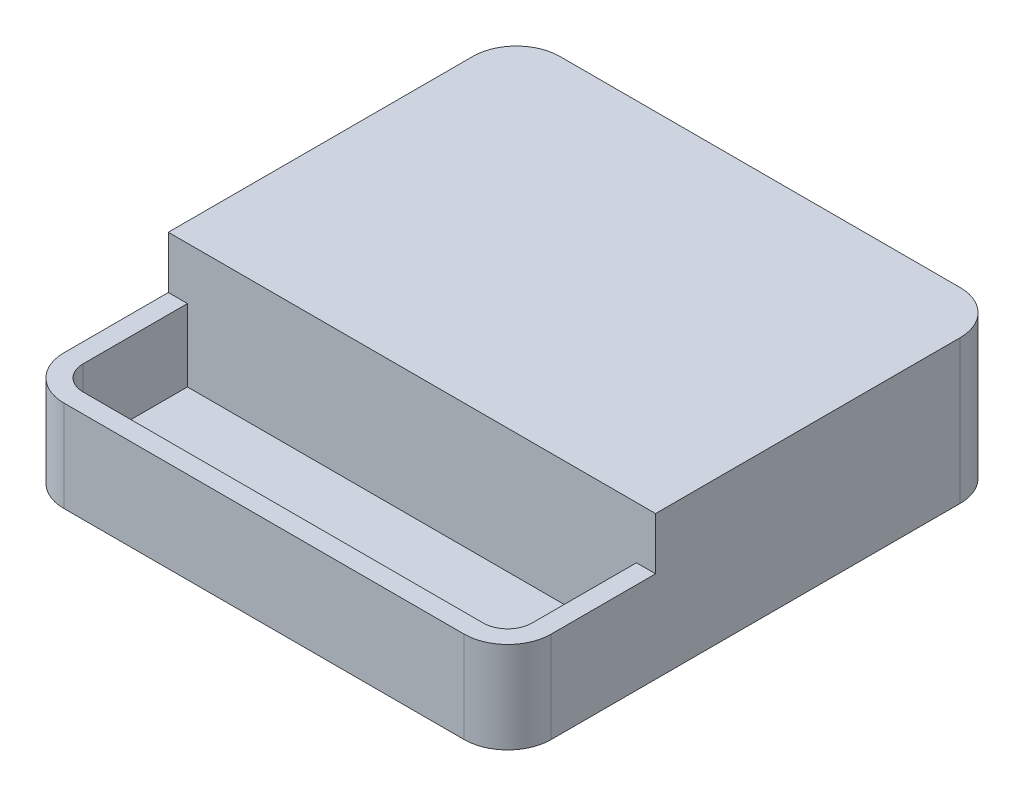
ISO-10303-21;
HEADER;
FILE_DESCRIPTION(('STEP AP214'),'2;1');
FILE_NAME('part.step','',(''),(''),'','','');
FILE_SCHEMA(('AUTOMOTIVE_DESIGN { 1 0 10303 214 1 1 1 1 }'));
ENDSEC;
DATA;
#1=APPLICATION_CONTEXT('core data for automotive mechanical design processes');
#2=APPLICATION_PROTOCOL_DEFINITION('international standard','automotive_design',2000,#1);
#3=PRODUCT_CONTEXT('',#1,'mechanical');
#4=PRODUCT('Part','Part','',(#3));
#5=PRODUCT_RELATED_PRODUCT_CATEGORY('part','',(#4));
#6=PRODUCT_DEFINITION_FORMATION('','',#4);
#7=PRODUCT_DEFINITION_CONTEXT('part definition',#1,'design');
#8=PRODUCT_DEFINITION('design','',#6,#7);
#9=PRODUCT_DEFINITION_SHAPE('','',#8);
#10=(LENGTH_UNIT() NAMED_UNIT(*) SI_UNIT(.MILLI.,.METRE.));
#11=(NAMED_UNIT(*) PLANE_ANGLE_UNIT() SI_UNIT($,.RADIAN.));
#12=(NAMED_UNIT(*) SI_UNIT($,.STERADIAN.) SOLID_ANGLE_UNIT());
#13=UNCERTAINTY_MEASURE_WITH_UNIT(LENGTH_MEASURE(1.E-05),#10,'distance_accuracy_value','');
#14=(GEOMETRIC_REPRESENTATION_CONTEXT(3) GLOBAL_UNCERTAINTY_ASSIGNED_CONTEXT((#13)) GLOBAL_UNIT_ASSIGNED_CONTEXT((#10,
#11,#12)) REPRESENTATION_CONTEXT('',''));
#15=CARTESIAN_POINT('',(0.,0.,0.));
#16=DIRECTION('',(0.,0.,1.));
#17=DIRECTION('',(1.,0.,0.));
#18=AXIS2_PLACEMENT_3D('',#15,#16,#17);
#19=CARTESIAN_POINT('',(-23.,16.5,23.5));
#20=DIRECTION('',(0.,-1.,0.));
#21=DIRECTION('',(0.,0.,-1.));
#22=AXIS2_PLACEMENT_3D('',#19,#20,#21);
#23=CYLINDRICAL_SURFACE('',#22,5.00000000000001);
#24=CARTESIAN_POINT('',(-23.,10.5,23.5));
#25=DIRECTION('',(0.,1.,0.));
#26=DIRECTION('',(0.,0.,1.));
#27=AXIS2_PLACEMENT_3D('',#24,#25,#26);
#28=CIRCLE('',#27,5.00000000000001);
#29=CARTESIAN_POINT('',(-28.,10.5,23.5));
#30=VERTEX_POINT('',#29);
#31=CARTESIAN_POINT('',(-23.,10.5,28.5));
#32=VERTEX_POINT('',#31);
#33=EDGE_CURVE('E221',#30,#32,#28,.T.);
#34=ORIENTED_EDGE('',*,*,#33,.F.);
#35=DIRECTION('',(0.,-1.,0.));
#36=VECTOR('',#35,1.);
#37=CARTESIAN_POINT('',(-28.,16.5,23.5));
#38=LINE('',#37,#36);
#39=CARTESIAN_POINT('',(-28.,0.,23.5));
#40=VERTEX_POINT('',#39);
#41=EDGE_CURVE('E271',#30,#40,#38,.T.);
#42=ORIENTED_EDGE('',*,*,#41,.T.);
#43=CARTESIAN_POINT('',(-23.,0.,23.5));
#44=DIRECTION('',(0.,1.,0.));
#45=DIRECTION('',(0.,0.,1.));
#46=AXIS2_PLACEMENT_3D('',#43,#44,#45);
#47=CIRCLE('',#46,5.00000000000001);
#48=CARTESIAN_POINT('',(-23.,0.,28.5));
#49=VERTEX_POINT('',#48);
#50=EDGE_CURVE('E243',#40,#49,#47,.T.);
#51=ORIENTED_EDGE('',*,*,#50,.T.);
#52=DIRECTION('',(0.,-1.,0.));
#53=VECTOR('',#52,1.);
#54=CARTESIAN_POINT('',(-23.,16.5,28.5));
#55=LINE('',#54,#53);
#56=EDGE_CURVE('E269',#32,#49,#55,.T.);
#57=ORIENTED_EDGE('',*,*,#56,.F.);
#58=EDGE_LOOP('',(#34,#42,#51,#57));
#59=FACE_BOUND('',#58,.T.);
#60=ADVANCED_FACE('F41',(#59),#23,.T.);
#61=CARTESIAN_POINT('',(-23.,16.5,28.5));
#62=DIRECTION('',(0.,0.,-1.));
#63=DIRECTION('',(-1.,0.,0.));
#64=AXIS2_PLACEMENT_3D('',#61,#62,#63);
#65=PLANE('',#64);
#66=DIRECTION('',(1.,0.,0.));
#67=VECTOR('',#66,1.);
#68=CARTESIAN_POINT('',(-28.,10.5,28.5));
#69=LINE('',#68,#67);
#70=CARTESIAN_POINT('',(23.,10.5,28.5));
#71=VERTEX_POINT('',#70);
#72=EDGE_CURVE('E206',#32,#71,#69,.T.);
#73=ORIENTED_EDGE('',*,*,#72,.F.);
#74=ORIENTED_EDGE('',*,*,#56,.T.);
#75=DIRECTION('',(1.,0.,0.));
#76=VECTOR('',#75,1.);
#77=CARTESIAN_POINT('',(-23.,0.,28.5));
#78=LINE('',#77,#76);
#79=CARTESIAN_POINT('',(23.,0.,28.5));
#80=VERTEX_POINT('',#79);
#81=EDGE_CURVE('E246',#49,#80,#78,.T.);
#82=ORIENTED_EDGE('',*,*,#81,.T.);
#83=DIRECTION('',(0.,-1.,0.));
#84=VECTOR('',#83,1.);
#85=CARTESIAN_POINT('',(23.,16.5,28.5));
#86=LINE('',#85,#84);
#87=EDGE_CURVE('E267',#71,#80,#86,.T.);
#88=ORIENTED_EDGE('',*,*,#87,.F.);
#89=EDGE_LOOP('',(#73,#74,#82,#88));
#90=FACE_BOUND('',#89,.T.);
#91=ADVANCED_FACE('F346',(#90),#65,.F.);
#92=CARTESIAN_POINT('',(23.,16.5,23.5));
#93=DIRECTION('',(0.,-1.,0.));
#94=DIRECTION('',(0.,0.,-1.));
#95=AXIS2_PLACEMENT_3D('',#92,#93,#94);
#96=CYLINDRICAL_SURFACE('',#95,5.);
#97=CARTESIAN_POINT('',(23.,10.5,23.5));
#98=DIRECTION('',(0.,1.,0.));
#99=DIRECTION('',(0.,0.,1.));
#100=AXIS2_PLACEMENT_3D('',#97,#98,#99);
#101=CIRCLE('',#100,5.);
#102=CARTESIAN_POINT('',(28.,10.5,23.5));
#103=VERTEX_POINT('',#102);
#104=EDGE_CURVE('E218',#71,#103,#101,.T.);
#105=ORIENTED_EDGE('',*,*,#104,.F.);
#106=ORIENTED_EDGE('',*,*,#87,.T.);
#107=CARTESIAN_POINT('',(23.,0.,23.5));
#108=DIRECTION('',(0.,1.,0.));
#109=DIRECTION('',(0.,0.,-1.));
#110=AXIS2_PLACEMENT_3D('',#107,#108,#109);
#111=CIRCLE('',#110,5.);
#112=CARTESIAN_POINT('',(28.,0.,23.5));
#113=VERTEX_POINT('',#112);
#114=EDGE_CURVE('E249',#80,#113,#111,.T.);
#115=ORIENTED_EDGE('',*,*,#114,.T.);
#116=DIRECTION('',(0.,-1.,0.));
#117=VECTOR('',#116,1.);
#118=CARTESIAN_POINT('',(28.,16.5,23.5));
#119=LINE('',#118,#117);
#120=EDGE_CURVE('E265',#103,#113,#119,.T.);
#121=ORIENTED_EDGE('',*,*,#120,.F.);
#122=EDGE_LOOP('',(#105,#106,#115,#121));
#123=FACE_BOUND('',#122,.T.);
#124=ADVANCED_FACE('F351',(#123),#96,.T.);
#125=CARTESIAN_POINT('',(-23.,16.5,-23.5));
#126=DIRECTION('',(0.,-1.,0.));
#127=DIRECTION('',(0.,0.,-1.));
#128=AXIS2_PLACEMENT_3D('',#125,#126,#127);
#129=CYLINDRICAL_SURFACE('',#128,5.);
#130=CARTESIAN_POINT('',(-23.,0.,-23.5));
#131=DIRECTION('',(0.,1.,0.));
#132=DIRECTION('',(0.,0.,1.));
#133=AXIS2_PLACEMENT_3D('',#130,#131,#132);
#134=CIRCLE('',#133,5.);
#135=CARTESIAN_POINT('',(-23.,0.,-28.5));
#136=VERTEX_POINT('',#135);
#137=CARTESIAN_POINT('',(-28.,0.,-23.5));
#138=VERTEX_POINT('',#137);
#139=EDGE_CURVE('E223',#136,#138,#134,.T.);
#140=ORIENTED_EDGE('',*,*,#139,.T.);
#141=DIRECTION('',(0.,-1.,0.));
#142=VECTOR('',#141,1.);
#143=CARTESIAN_POINT('',(-28.,16.5,-23.5));
#144=LINE('',#143,#142);
#145=CARTESIAN_POINT('',(-28.,16.5,-23.5));
#146=VERTEX_POINT('',#145);
#147=EDGE_CURVE('E273',#146,#138,#144,.T.);
#148=ORIENTED_EDGE('',*,*,#147,.F.);
#149=CARTESIAN_POINT('',(-23.,16.5,-23.5));
#150=DIRECTION('',(0.,1.,0.));
#151=DIRECTION('',(0.,0.,1.));
#152=AXIS2_PLACEMENT_3D('',#149,#150,#151);
#153=CIRCLE('',#152,5.);
#154=CARTESIAN_POINT('',(-23.,16.5,-28.5));
#155=VERTEX_POINT('',#154);
#156=EDGE_CURVE('E224',#155,#146,#153,.T.);
#157=ORIENTED_EDGE('',*,*,#156,.F.);
#158=DIRECTION('',(0.,-1.,0.));
#159=VECTOR('',#158,1.);
#160=CARTESIAN_POINT('',(-23.,16.5,-28.5));
#161=LINE('',#160,#159);
#162=EDGE_CURVE('E237',#155,#136,#161,.T.);
#163=ORIENTED_EDGE('',*,*,#162,.T.);
#164=EDGE_LOOP('',(#140,#148,#157,#163));
#165=FACE_BOUND('',#164,.T.);
#166=ADVANCED_FACE('F43',(#165),#129,.T.);
#167=CARTESIAN_POINT('',(-28.,16.5,-23.5));
#168=DIRECTION('',(1.,0.,0.));
#169=DIRECTION('',(0.,0.,-1.));
#170=AXIS2_PLACEMENT_3D('',#167,#168,#169);
#171=PLANE('',#170);
#172=DIRECTION('',(0.,0.,1.));
#173=VECTOR('',#172,1.);
#174=CARTESIAN_POINT('',(-28.,10.5,11.5));
#175=LINE('',#174,#173);
#176=CARTESIAN_POINT('',(-28.,10.5,11.5));
#177=VERTEX_POINT('',#176);
#178=EDGE_CURVE('E204',#177,#30,#175,.T.);
#179=ORIENTED_EDGE('',*,*,#178,.F.);
#180=DIRECTION('',(0.,1.,0.));
#181=VECTOR('',#180,1.);
#182=CARTESIAN_POINT('',(-28.,10.5,11.5));
#183=LINE('',#182,#181);
#184=CARTESIAN_POINT('',(-28.,16.5,11.5));
#185=VERTEX_POINT('',#184);
#186=EDGE_CURVE('E215',#177,#185,#183,.T.);
#187=ORIENTED_EDGE('',*,*,#186,.T.);
#188=DIRECTION('',(0.,0.,1.));
#189=VECTOR('',#188,1.);
#190=CARTESIAN_POINT('',(-28.,16.5,-23.5));
#191=LINE('',#190,#189);
#192=EDGE_CURVE('E227',#146,#185,#191,.T.);
#193=ORIENTED_EDGE('',*,*,#192,.F.);
#194=ORIENTED_EDGE('',*,*,#147,.T.);
#195=DIRECTION('',(0.,0.,1.));
#196=VECTOR('',#195,1.);
#197=CARTESIAN_POINT('',(-28.,0.,-23.5));
#198=LINE('',#197,#196);
#199=EDGE_CURVE('E240',#138,#40,#198,.T.);
#200=ORIENTED_EDGE('',*,*,#199,.T.);
#201=ORIENTED_EDGE('',*,*,#41,.F.);
#202=EDGE_LOOP('',(#179,#187,#193,#194,#200,#201));
#203=FACE_BOUND('',#202,.T.);
#204=ADVANCED_FACE('F335',(#203),#171,.F.);
#205=CARTESIAN_POINT('',(28.,16.5,-23.5));
#206=DIRECTION('',(-1.,0.,0.));
#207=DIRECTION('',(0.,0.,1.));
#208=AXIS2_PLACEMENT_3D('',#205,#206,#207);
#209=PLANE('',#208);
#210=DIRECTION('',(0.,0.,-1.));
#211=VECTOR('',#210,1.);
#212=CARTESIAN_POINT('',(28.,16.5,-23.5));
#213=LINE('',#212,#211);
#214=CARTESIAN_POINT('',(28.,16.5,11.5));
#215=VERTEX_POINT('',#214);
#216=CARTESIAN_POINT('',(28.,16.5,-23.5));
#217=VERTEX_POINT('',#216);
#218=EDGE_CURVE('E231',#215,#217,#213,.T.);
#219=ORIENTED_EDGE('',*,*,#218,.F.);
#220=DIRECTION('',(0.,1.,0.));
#221=VECTOR('',#220,1.);
#222=CARTESIAN_POINT('',(28.,10.5,11.5));
#223=LINE('',#222,#221);
#224=CARTESIAN_POINT('',(28.,10.5,11.5));
#225=VERTEX_POINT('',#224);
#226=EDGE_CURVE('E66',#225,#215,#223,.T.);
#227=ORIENTED_EDGE('',*,*,#226,.F.);
#228=DIRECTION('',(0.,0.,-1.));
#229=VECTOR('',#228,1.);
#230=CARTESIAN_POINT('',(28.,10.5,11.5));
#231=LINE('',#230,#229);
#232=EDGE_CURVE('E208',#103,#225,#231,.T.);
#233=ORIENTED_EDGE('',*,*,#232,.F.);
#234=ORIENTED_EDGE('',*,*,#120,.T.);
#235=DIRECTION('',(0.,0.,-1.));
#236=VECTOR('',#235,1.);
#237=CARTESIAN_POINT('',(28.,0.,-23.5));
#238=LINE('',#237,#236);
#239=CARTESIAN_POINT('',(28.,0.,-23.5));
#240=VERTEX_POINT('',#239);
#241=EDGE_CURVE('E252',#113,#240,#238,.T.);
#242=ORIENTED_EDGE('',*,*,#241,.T.);
#243=DIRECTION('',(0.,-1.,0.));
#244=VECTOR('',#243,1.);
#245=CARTESIAN_POINT('',(28.,16.5,-23.5));
#246=LINE('',#245,#244);
#247=EDGE_CURVE('E262',#217,#240,#246,.T.);
#248=ORIENTED_EDGE('',*,*,#247,.F.);
#249=EDGE_LOOP('',(#219,#227,#233,#234,#242,#248));
#250=FACE_BOUND('',#249,.T.);
#251=ADVANCED_FACE('F354',(#250),#209,.F.);
#252=CARTESIAN_POINT('',(23.,16.5,-23.5));
#253=DIRECTION('',(0.,-1.,0.));
#254=DIRECTION('',(0.,0.,-1.));
#255=AXIS2_PLACEMENT_3D('',#252,#253,#254);
#256=CYLINDRICAL_SURFACE('',#255,4.99999999999999);
#257=CARTESIAN_POINT('',(23.,0.,-23.5));
#258=DIRECTION('',(0.,1.,0.));
#259=DIRECTION('',(0.,0.,-1.));
#260=AXIS2_PLACEMENT_3D('',#257,#258,#259);
#261=CIRCLE('',#260,4.99999999999999);
#262=CARTESIAN_POINT('',(23.,0.,-28.5));
#263=VERTEX_POINT('',#262);
#264=EDGE_CURVE('E254',#240,#263,#261,.T.);
#265=ORIENTED_EDGE('',*,*,#264,.T.);
#266=DIRECTION('',(0.,-1.,0.));
#267=VECTOR('',#266,1.);
#268=CARTESIAN_POINT('',(23.,16.5,-28.5));
#269=LINE('',#268,#267);
#270=CARTESIAN_POINT('',(23.,16.5,-28.5));
#271=VERTEX_POINT('',#270);
#272=EDGE_CURVE('E259',#271,#263,#269,.T.);
#273=ORIENTED_EDGE('',*,*,#272,.F.);
#274=CARTESIAN_POINT('',(23.,16.5,-23.5));
#275=DIRECTION('',(0.,1.,0.));
#276=DIRECTION('',(0.,0.,-1.));
#277=AXIS2_PLACEMENT_3D('',#274,#275,#276);
#278=CIRCLE('',#277,4.99999999999999);
#279=EDGE_CURVE('E233',#217,#271,#278,.T.);
#280=ORIENTED_EDGE('',*,*,#279,.F.);
#281=ORIENTED_EDGE('',*,*,#247,.T.);
#282=EDGE_LOOP('',(#265,#273,#280,#281));
#283=FACE_BOUND('',#282,.T.);
#284=ADVANCED_FACE('F384',(#283),#256,.T.);
#285=CARTESIAN_POINT('',(-23.,16.5,-28.5));
#286=DIRECTION('',(0.,0.,1.));
#287=DIRECTION('',(1.,0.,0.));
#288=AXIS2_PLACEMENT_3D('',#285,#286,#287);
#289=PLANE('',#288);
#290=DIRECTION('',(-1.,0.,0.));
#291=VECTOR('',#290,1.);
#292=CARTESIAN_POINT('',(-23.,0.,-28.5));
#293=LINE('',#292,#291);
#294=EDGE_CURVE('E228',#263,#136,#293,.T.);
#295=ORIENTED_EDGE('',*,*,#294,.T.);
#296=ORIENTED_EDGE('',*,*,#162,.F.);
#297=DIRECTION('',(-1.,0.,0.));
#298=VECTOR('',#297,1.);
#299=CARTESIAN_POINT('',(-23.,16.5,-28.5));
#300=LINE('',#299,#298);
#301=EDGE_CURVE('E235',#271,#155,#300,.T.);
#302=ORIENTED_EDGE('',*,*,#301,.F.);
#303=ORIENTED_EDGE('',*,*,#272,.T.);
#304=EDGE_LOOP('',(#295,#296,#302,#303));
#305=FACE_BOUND('',#304,.T.);
#306=ADVANCED_FACE('F395',(#305),#289,.F.);
#307=CARTESIAN_POINT('',(-23.,16.5,-23.5));
#308=DIRECTION('',(0.,1.,0.));
#309=DIRECTION('',(0.,0.,1.));
#310=AXIS2_PLACEMENT_3D('',#307,#308,#309);
#311=PLANE('',#310);
#312=DIRECTION('',(-1.,0.,0.));
#313=VECTOR('',#312,1.);
#314=CARTESIAN_POINT('',(-28.,16.5,11.5));
#315=LINE('',#314,#313);
#316=EDGE_CURVE('E202',#215,#185,#315,.T.);
#317=ORIENTED_EDGE('',*,*,#316,.F.);
#318=ORIENTED_EDGE('',*,*,#218,.T.);
#319=ORIENTED_EDGE('',*,*,#279,.T.);
#320=ORIENTED_EDGE('',*,*,#301,.T.);
#321=ORIENTED_EDGE('',*,*,#156,.T.);
#322=ORIENTED_EDGE('',*,*,#192,.T.);
#323=EDGE_LOOP('',(#317,#318,#319,#320,#321,#322));
#324=FACE_BOUND('',#323,.T.);
#325=ADVANCED_FACE('F401',(#324),#311,.T.);
#326=CARTESIAN_POINT('',(-23.,0.,-23.5));
#327=DIRECTION('',(0.,1.,0.));
#328=DIRECTION('',(0.,0.,1.));
#329=AXIS2_PLACEMENT_3D('',#326,#327,#328);
#330=PLANE('',#329);
#331=CARTESIAN_POINT('',(21.,0.,-23.5));
#332=DIRECTION('',(0.,1.,0.));
#333=DIRECTION('',(0.,0.,1.));
#334=AXIS2_PLACEMENT_3D('',#331,#332,#333);
#335=CIRCLE('',#334,0.499999999999999);
#336=CARTESIAN_POINT('',(21.,0.,-23.));
#337=VERTEX_POINT('',#336);
#338=EDGE_CURVE('E45',#337,#337,#335,.F.);
#339=ORIENTED_EDGE('',*,*,#338,.F.);
#340=EDGE_LOOP('',(#339));
#341=FACE_BOUND('',#340,.T.);
#342=CARTESIAN_POINT('',(-21.,0.,-23.5));
#343=DIRECTION('',(0.,1.,0.));
#344=DIRECTION('',(0.,0.,1.));
#345=AXIS2_PLACEMENT_3D('',#342,#343,#344);
#346=CIRCLE('',#345,0.499999999999999);
#347=CARTESIAN_POINT('',(-21.,0.,-23.));
#348=VERTEX_POINT('',#347);
#349=EDGE_CURVE('E284',#348,#348,#346,.F.);
#350=ORIENTED_EDGE('',*,*,#349,.F.);
#351=EDGE_LOOP('',(#350));
#352=FACE_BOUND('',#351,.T.);
#353=CARTESIAN_POINT('',(-21.,0.,23.5));
#354=DIRECTION('',(0.,1.,0.));
#355=DIRECTION('',(0.,0.,1.));
#356=AXIS2_PLACEMENT_3D('',#353,#354,#355);
#357=CIRCLE('',#356,0.499999999999999);
#358=CARTESIAN_POINT('',(-21.,0.,24.));
#359=VERTEX_POINT('',#358);
#360=EDGE_CURVE('E282',#359,#359,#357,.F.);
#361=ORIENTED_EDGE('',*,*,#360,.F.);
#362=EDGE_LOOP('',(#361));
#363=FACE_BOUND('',#362,.T.);
#364=CARTESIAN_POINT('',(21.,0.,23.5));
#365=DIRECTION('',(0.,1.,0.));
#366=DIRECTION('',(0.,0.,1.));
#367=AXIS2_PLACEMENT_3D('',#364,#365,#366);
#368=CIRCLE('',#367,0.499999999999999);
#369=CARTESIAN_POINT('',(21.,0.,24.));
#370=VERTEX_POINT('',#369);
#371=EDGE_CURVE('E279',#370,#370,#368,.F.);
#372=ORIENTED_EDGE('',*,*,#371,.F.);
#373=EDGE_LOOP('',(#372));
#374=FACE_BOUND('',#373,.T.);
#375=CARTESIAN_POINT('',(0.,0.,0.));
#376=DIRECTION('',(0.,1.,0.));
#377=DIRECTION('',(0.,0.,1.));
#378=AXIS2_PLACEMENT_3D('',#375,#376,#377);
#379=CIRCLE('',#378,7.);
#380=CARTESIAN_POINT('',(0.,0.,7.));
#381=VERTEX_POINT('',#380);
#382=EDGE_CURVE('E276',#381,#381,#379,.F.);
#383=ORIENTED_EDGE('',*,*,#382,.F.);
#384=EDGE_LOOP('',(#383));
#385=FACE_BOUND('',#384,.T.);
#386=ORIENTED_EDGE('',*,*,#139,.F.);
#387=ORIENTED_EDGE('',*,*,#294,.F.);
#388=ORIENTED_EDGE('',*,*,#264,.F.);
#389=ORIENTED_EDGE('',*,*,#241,.F.);
#390=ORIENTED_EDGE('',*,*,#114,.F.);
#391=ORIENTED_EDGE('',*,*,#81,.F.);
#392=ORIENTED_EDGE('',*,*,#50,.F.);
#393=ORIENTED_EDGE('',*,*,#199,.F.);
#394=EDGE_LOOP('',(#386,#387,#388,#389,#390,#391,#392,#393));
#395=FACE_BOUND('',#394,.T.);
#396=ADVANCED_FACE('F341',(#341,#352,#363,#374,#385,#395),#330,.F.);
#397=CARTESIAN_POINT('',(0.,10.5,0.));
#398=DIRECTION('',(0.,1.,0.));
#399=DIRECTION('',(0.,0.,1.));
#400=AXIS2_PLACEMENT_3D('',#397,#398,#399);
#401=PLANE('',#400);
#402=DIRECTION('',(0.,0.,1.));
#403=VECTOR('',#402,1.);
#404=CARTESIAN_POINT('',(-25.8,10.5,11.5));
#405=LINE('',#404,#403);
#406=CARTESIAN_POINT('',(-25.8,10.5,11.5));
#407=VERTEX_POINT('',#406);
#408=CARTESIAN_POINT('',(-25.8,10.5,23.5));
#409=VERTEX_POINT('',#408);
#410=EDGE_CURVE('E172',#407,#409,#405,.T.);
#411=ORIENTED_EDGE('',*,*,#410,.F.);
#412=DIRECTION('',(-1.,0.,0.));
#413=VECTOR('',#412,1.);
#414=CARTESIAN_POINT('',(-28.,10.5,11.5));
#415=LINE('',#414,#413);
#416=EDGE_CURVE('E210',#407,#177,#415,.T.);
#417=ORIENTED_EDGE('',*,*,#416,.T.);
#418=ORIENTED_EDGE('',*,*,#178,.T.);
#419=ORIENTED_EDGE('',*,*,#33,.T.);
#420=ORIENTED_EDGE('',*,*,#72,.T.);
#421=ORIENTED_EDGE('',*,*,#104,.T.);
#422=ORIENTED_EDGE('',*,*,#232,.T.);
#423=CARTESIAN_POINT('',(25.8,10.5,11.5));
#424=VERTEX_POINT('',#423);
#425=EDGE_CURVE('E211',#225,#424,#415,.T.);
#426=ORIENTED_EDGE('',*,*,#425,.T.);
#427=DIRECTION('',(0.,0.,-1.));
#428=VECTOR('',#427,1.);
#429=CARTESIAN_POINT('',(25.8,10.5,11.5));
#430=LINE('',#429,#428);
#431=CARTESIAN_POINT('',(25.8,10.5,23.5));
#432=VERTEX_POINT('',#431);
#433=EDGE_CURVE('E58',#432,#424,#430,.T.);
#434=ORIENTED_EDGE('',*,*,#433,.F.);
#435=CARTESIAN_POINT('',(23.,10.5,23.5));
#436=DIRECTION('',(0.,1.,0.));
#437=DIRECTION('',(0.,0.,1.));
#438=AXIS2_PLACEMENT_3D('',#435,#436,#437);
#439=CIRCLE('',#438,2.8);
#440=CARTESIAN_POINT('',(23.,10.5,26.3));
#441=VERTEX_POINT('',#440);
#442=EDGE_CURVE('E185',#441,#432,#439,.T.);
#443=ORIENTED_EDGE('',*,*,#442,.F.);
#444=DIRECTION('',(1.,0.,0.));
#445=VECTOR('',#444,1.);
#446=CARTESIAN_POINT('',(-23.,10.5,26.3));
#447=LINE('',#446,#445);
#448=CARTESIAN_POINT('',(-23.,10.5,26.3));
#449=VERTEX_POINT('',#448);
#450=EDGE_CURVE('E183',#449,#441,#447,.T.);
#451=ORIENTED_EDGE('',*,*,#450,.F.);
#452=CARTESIAN_POINT('',(-23.,10.5,23.5));
#453=DIRECTION('',(0.,1.,0.));
#454=DIRECTION('',(0.,0.,1.));
#455=AXIS2_PLACEMENT_3D('',#452,#453,#454);
#456=CIRCLE('',#455,2.80000000000001);
#457=EDGE_CURVE('E163',#409,#449,#456,.T.);
#458=ORIENTED_EDGE('',*,*,#457,.F.);
#459=EDGE_LOOP('',(#411,#417,#418,#419,#420,#421,#422,#426,#434,#443,#451,#458));
#460=FACE_BOUND('',#459,.T.);
#461=ADVANCED_FACE('F180',(#460),#401,.T.);
#462=CARTESIAN_POINT('',(-28.,10.5,11.5));
#463=DIRECTION('',(0.,0.,-1.));
#464=DIRECTION('',(-1.,0.,0.));
#465=AXIS2_PLACEMENT_3D('',#462,#463,#464);
#466=PLANE('',#465);
#467=ORIENTED_EDGE('',*,*,#316,.T.);
#468=ORIENTED_EDGE('',*,*,#186,.F.);
#469=ORIENTED_EDGE('',*,*,#416,.F.);
#470=DIRECTION('',(0.,1.,0.));
#471=VECTOR('',#470,1.);
#472=CARTESIAN_POINT('',(-25.8,-53.6805365099865,11.5));
#473=LINE('',#472,#471);
#474=CARTESIAN_POINT('',(-25.8,2.2,11.5));
#475=VERTEX_POINT('',#474);
#476=EDGE_CURVE('E175',#475,#407,#473,.T.);
#477=ORIENTED_EDGE('',*,*,#476,.F.);
#478=DIRECTION('',(1.,0.,0.));
#479=VECTOR('',#478,1.);
#480=CARTESIAN_POINT('',(-25.8,2.2,11.5));
#481=LINE('',#480,#479);
#482=CARTESIAN_POINT('',(25.8,2.2,11.5));
#483=VERTEX_POINT('',#482);
#484=EDGE_CURVE('E320',#475,#483,#481,.T.);
#485=ORIENTED_EDGE('',*,*,#484,.T.);
#486=DIRECTION('',(0.,1.,0.));
#487=VECTOR('',#486,1.);
#488=CARTESIAN_POINT('',(25.8,-53.6805365099865,11.5));
#489=LINE('',#488,#487);
#490=EDGE_CURVE('E194',#483,#424,#489,.T.);
#491=ORIENTED_EDGE('',*,*,#490,.T.);
#492=ORIENTED_EDGE('',*,*,#425,.F.);
#493=ORIENTED_EDGE('',*,*,#226,.T.);
#494=EDGE_LOOP('',(#467,#468,#469,#477,#485,#491,#492,#493));
#495=FACE_BOUND('',#494,.T.);
#496=ADVANCED_FACE('F326',(#495),#466,.F.);
#497=CARTESIAN_POINT('',(-25.8,-53.6805365099865,11.5));
#498=DIRECTION('',(-1.,0.,0.));
#499=DIRECTION('',(0.,0.,1.));
#500=AXIS2_PLACEMENT_3D('',#497,#498,#499);
#501=PLANE('',#500);
#502=DIRECTION('',(0.,0.,-1.));
#503=VECTOR('',#502,1.);
#504=CARTESIAN_POINT('',(-25.8,2.2,11.5));
#505=LINE('',#504,#503);
#506=CARTESIAN_POINT('',(-25.8,2.2,23.5));
#507=VERTEX_POINT('',#506);
#508=EDGE_CURVE('E203',#507,#475,#505,.T.);
#509=ORIENTED_EDGE('',*,*,#508,.T.);
#510=ORIENTED_EDGE('',*,*,#476,.T.);
#511=ORIENTED_EDGE('',*,*,#410,.T.);
#512=DIRECTION('',(0.,1.,0.));
#513=VECTOR('',#512,1.);
#514=CARTESIAN_POINT('',(-25.8,-53.6805365099865,23.5));
#515=LINE('',#514,#513);
#516=EDGE_CURVE('E158',#507,#409,#515,.T.);
#517=ORIENTED_EDGE('',*,*,#516,.F.);
#518=EDGE_LOOP('',(#509,#510,#511,#517));
#519=FACE_BOUND('',#518,.T.);
#520=ADVANCED_FACE('F173',(#519),#501,.F.);
#521=CARTESIAN_POINT('',(25.8,-53.6805365099865,11.5));
#522=DIRECTION('',(1.,0.,0.));
#523=DIRECTION('',(0.,0.,-1.));
#524=AXIS2_PLACEMENT_3D('',#521,#522,#523);
#525=PLANE('',#524);
#526=DIRECTION('',(0.,0.,1.));
#527=VECTOR('',#526,1.);
#528=CARTESIAN_POINT('',(25.8,2.2,11.5));
#529=LINE('',#528,#527);
#530=CARTESIAN_POINT('',(25.8,2.2,23.5));
#531=VERTEX_POINT('',#530);
#532=EDGE_CURVE('E318',#483,#531,#529,.T.);
#533=ORIENTED_EDGE('',*,*,#532,.T.);
#534=DIRECTION('',(0.,1.,0.));
#535=VECTOR('',#534,1.);
#536=CARTESIAN_POINT('',(25.8,-53.6805365099865,23.5));
#537=LINE('',#536,#535);
#538=EDGE_CURVE('E196',#531,#432,#537,.T.);
#539=ORIENTED_EDGE('',*,*,#538,.T.);
#540=ORIENTED_EDGE('',*,*,#433,.T.);
#541=ORIENTED_EDGE('',*,*,#490,.F.);
#542=EDGE_LOOP('',(#533,#539,#540,#541));
#543=FACE_BOUND('',#542,.T.);
#544=ADVANCED_FACE('F356',(#543),#525,.F.);
#545=CARTESIAN_POINT('',(23.,-53.6805365099865,23.5));
#546=DIRECTION('',(0.,1.,0.));
#547=DIRECTION('',(0.,0.,1.));
#548=AXIS2_PLACEMENT_3D('',#545,#546,#547);
#549=CYLINDRICAL_SURFACE('',#548,2.8);
#550=CARTESIAN_POINT('',(23.,2.2,23.5));
#551=DIRECTION('',(0.,1.,0.));
#552=DIRECTION('',(0.,0.,1.));
#553=AXIS2_PLACEMENT_3D('',#550,#551,#552);
#554=CIRCLE('',#553,2.8);
#555=CARTESIAN_POINT('',(23.,2.2,26.3));
#556=VERTEX_POINT('',#555);
#557=EDGE_CURVE('E316',#531,#556,#554,.F.);
#558=ORIENTED_EDGE('',*,*,#557,.T.);
#559=DIRECTION('',(0.,1.,0.));
#560=VECTOR('',#559,1.);
#561=CARTESIAN_POINT('',(23.,-53.6805365099865,26.3));
#562=LINE('',#561,#560);
#563=EDGE_CURVE('E198',#556,#441,#562,.T.);
#564=ORIENTED_EDGE('',*,*,#563,.T.);
#565=ORIENTED_EDGE('',*,*,#442,.T.);
#566=ORIENTED_EDGE('',*,*,#538,.F.);
#567=EDGE_LOOP('',(#558,#564,#565,#566));
#568=FACE_BOUND('',#567,.T.);
#569=ADVANCED_FACE('F361',(#568),#549,.F.);
#570=CARTESIAN_POINT('',(-23.,-53.6805365099865,26.3));
#571=DIRECTION('',(0.,0.,1.));
#572=DIRECTION('',(1.,0.,0.));
#573=AXIS2_PLACEMENT_3D('',#570,#571,#572);
#574=PLANE('',#573);
#575=DIRECTION('',(-1.,0.,0.));
#576=VECTOR('',#575,1.);
#577=CARTESIAN_POINT('',(-23.,2.2,26.3));
#578=LINE('',#577,#576);
#579=CARTESIAN_POINT('',(-23.,2.2,26.3));
#580=VERTEX_POINT('',#579);
#581=EDGE_CURVE('E193',#556,#580,#578,.T.);
#582=ORIENTED_EDGE('',*,*,#581,.T.);
#583=DIRECTION('',(0.,1.,0.));
#584=VECTOR('',#583,1.);
#585=CARTESIAN_POINT('',(-23.,-53.6805365099865,26.3));
#586=LINE('',#585,#584);
#587=EDGE_CURVE('E169',#580,#449,#586,.T.);
#588=ORIENTED_EDGE('',*,*,#587,.T.);
#589=ORIENTED_EDGE('',*,*,#450,.T.);
#590=ORIENTED_EDGE('',*,*,#563,.F.);
#591=EDGE_LOOP('',(#582,#588,#589,#590));
#592=FACE_BOUND('',#591,.T.);
#593=ADVANCED_FACE('F363',(#592),#574,.F.);
#594=CARTESIAN_POINT('',(-23.,-53.6805365099865,23.5));
#595=DIRECTION('',(0.,1.,0.));
#596=DIRECTION('',(0.,0.,1.));
#597=AXIS2_PLACEMENT_3D('',#594,#595,#596);
#598=CYLINDRICAL_SURFACE('',#597,2.80000000000001);
#599=CARTESIAN_POINT('',(-23.,2.2,23.5));
#600=DIRECTION('',(0.,1.,0.));
#601=DIRECTION('',(0.,0.,1.));
#602=AXIS2_PLACEMENT_3D('',#599,#600,#601);
#603=CIRCLE('',#602,2.80000000000001);
#604=EDGE_CURVE('E166',#580,#507,#603,.F.);
#605=ORIENTED_EDGE('',*,*,#604,.T.);
#606=ORIENTED_EDGE('',*,*,#516,.T.);
#607=ORIENTED_EDGE('',*,*,#457,.T.);
#608=ORIENTED_EDGE('',*,*,#587,.F.);
#609=EDGE_LOOP('',(#605,#606,#607,#608));
#610=FACE_BOUND('',#609,.T.);
#611=ADVANCED_FACE('F160',(#610),#598,.F.);
#612=CARTESIAN_POINT('',(-23.,2.2,-23.5));
#613=DIRECTION('',(0.,1.,0.));
#614=DIRECTION('',(0.,0.,1.));
#615=AXIS2_PLACEMENT_3D('',#612,#613,#614);
#616=PLANE('',#615);
#617=ORIENTED_EDGE('',*,*,#508,.F.);
#618=ORIENTED_EDGE('',*,*,#604,.F.);
#619=ORIENTED_EDGE('',*,*,#581,.F.);
#620=ORIENTED_EDGE('',*,*,#557,.F.);
#621=ORIENTED_EDGE('',*,*,#532,.F.);
#622=ORIENTED_EDGE('',*,*,#484,.F.);
#623=EDGE_LOOP('',(#617,#618,#619,#620,#621,#622));
#624=FACE_BOUND('',#623,.T.);
#625=ADVANCED_FACE('F324',(#624),#616,.T.);
#626=CARTESIAN_POINT('',(0.,-1.,0.));
#627=DIRECTION('',(0.,1.,0.));
#628=DIRECTION('',(0.,0.,1.));
#629=AXIS2_PLACEMENT_3D('',#626,#627,#628);
#630=CYLINDRICAL_SURFACE('',#629,7.);
#631=CARTESIAN_POINT('',(0.,-1.,0.));
#632=DIRECTION('',(0.,-1.,0.));
#633=DIRECTION('',(0.,0.,-1.));
#634=AXIS2_PLACEMENT_3D('',#631,#632,#633);
#635=CIRCLE('',#634,7.);
#636=CARTESIAN_POINT('',(0.,-1.,-7.));
#637=VERTEX_POINT('',#636);
#638=EDGE_CURVE('E178',#637,#637,#635,.T.);
#639=ORIENTED_EDGE('',*,*,#638,.F.);
#640=EDGE_LOOP('',(#639));
#641=FACE_BOUND('',#640,.T.);
#642=ORIENTED_EDGE('',*,*,#382,.T.);
#643=EDGE_LOOP('',(#642));
#644=FACE_BOUND('',#643,.T.);
#645=ADVANCED_FACE('F520',(#641,#644),#630,.T.);
#646=CARTESIAN_POINT('',(0.,-1.,0.));
#647=DIRECTION('',(0.,-1.,0.));
#648=DIRECTION('',(0.,0.,-1.));
#649=AXIS2_PLACEMENT_3D('',#646,#647,#648);
#650=PLANE('',#649);
#651=CARTESIAN_POINT('',(0.,-1.,0.));
#652=DIRECTION('',(0.,-1.,0.));
#653=DIRECTION('',(0.,0.,-1.));
#654=AXIS2_PLACEMENT_3D('',#651,#652,#653);
#655=CIRCLE('',#654,4.);
#656=CARTESIAN_POINT('',(0.,-1.,-4.));
#657=VERTEX_POINT('',#656);
#658=EDGE_CURVE('E289',#657,#657,#655,.T.);
#659=ORIENTED_EDGE('',*,*,#658,.F.);
#660=EDGE_LOOP('',(#659));
#661=FACE_BOUND('',#660,.T.);
#662=ORIENTED_EDGE('',*,*,#638,.T.);
#663=EDGE_LOOP('',(#662));
#664=FACE_BOUND('',#663,.T.);
#665=ADVANCED_FACE('F535',(#661,#664),#650,.T.);
#666=CARTESIAN_POINT('',(21.,-1.,23.5));
#667=DIRECTION('',(0.,1.,0.));
#668=DIRECTION('',(0.,0.,1.));
#669=AXIS2_PLACEMENT_3D('',#666,#667,#668);
#670=CYLINDRICAL_SURFACE('',#669,0.499999999999999);
#671=CARTESIAN_POINT('',(21.,-1.,23.5));
#672=DIRECTION('',(0.,-1.,0.));
#673=DIRECTION('',(0.,0.,-1.));
#674=AXIS2_PLACEMENT_3D('',#671,#672,#673);
#675=CIRCLE('',#674,0.499999999999999);
#676=CARTESIAN_POINT('',(21.,-1.,23.));
#677=VERTEX_POINT('',#676);
#678=EDGE_CURVE('E310',#677,#677,#675,.T.);
#679=ORIENTED_EDGE('',*,*,#678,.F.);
#680=EDGE_LOOP('',(#679));
#681=FACE_BOUND('',#680,.T.);
#682=ORIENTED_EDGE('',*,*,#371,.T.);
#683=EDGE_LOOP('',(#682));
#684=FACE_BOUND('',#683,.T.);
#685=ADVANCED_FACE('F544',(#681,#684),#670,.T.);
#686=CARTESIAN_POINT('',(21.,-1.,23.5));
#687=DIRECTION('',(0.,-1.,0.));
#688=DIRECTION('',(0.,0.,-1.));
#689=AXIS2_PLACEMENT_3D('',#686,#687,#688);
#690=PLANE('',#689);
#691=ORIENTED_EDGE('',*,*,#678,.T.);
#692=EDGE_LOOP('',(#691));
#693=FACE_BOUND('',#692,.T.);
#694=ADVANCED_FACE('F549',(#693),#690,.T.);
#695=CARTESIAN_POINT('',(-21.,-1.,23.5));
#696=DIRECTION('',(0.,1.,0.));
#697=DIRECTION('',(0.,0.,1.));
#698=AXIS2_PLACEMENT_3D('',#695,#696,#697);
#699=CYLINDRICAL_SURFACE('',#698,0.499999999999999);
#700=CARTESIAN_POINT('',(-21.,-1.,23.5));
#701=DIRECTION('',(0.,-1.,0.));
#702=DIRECTION('',(0.,0.,-1.));
#703=AXIS2_PLACEMENT_3D('',#700,#701,#702);
#704=CIRCLE('',#703,0.499999999999999);
#705=CARTESIAN_POINT('',(-21.,-1.,23.));
#706=VERTEX_POINT('',#705);
#707=EDGE_CURVE('E307',#706,#706,#704,.T.);
#708=ORIENTED_EDGE('',*,*,#707,.F.);
#709=EDGE_LOOP('',(#708));
#710=FACE_BOUND('',#709,.T.);
#711=ORIENTED_EDGE('',*,*,#360,.T.);
#712=EDGE_LOOP('',(#711));
#713=FACE_BOUND('',#712,.T.);
#714=ADVANCED_FACE('F560',(#710,#713),#699,.T.);
#715=CARTESIAN_POINT('',(-21.,-1.,23.5));
#716=DIRECTION('',(0.,-1.,0.));
#717=DIRECTION('',(0.,0.,-1.));
#718=AXIS2_PLACEMENT_3D('',#715,#716,#717);
#719=PLANE('',#718);
#720=ORIENTED_EDGE('',*,*,#707,.T.);
#721=EDGE_LOOP('',(#720));
#722=FACE_BOUND('',#721,.T.);
#723=ADVANCED_FACE('F571',(#722),#719,.T.);
#724=CARTESIAN_POINT('',(-21.,-1.,-23.5));
#725=DIRECTION('',(0.,1.,0.));
#726=DIRECTION('',(0.,0.,1.));
#727=AXIS2_PLACEMENT_3D('',#724,#725,#726);
#728=CYLINDRICAL_SURFACE('',#727,0.499999999999999);
#729=CARTESIAN_POINT('',(-21.,-1.,-23.5));
#730=DIRECTION('',(0.,-1.,0.));
#731=DIRECTION('',(0.,0.,-1.));
#732=AXIS2_PLACEMENT_3D('',#729,#730,#731);
#733=CIRCLE('',#732,0.499999999999999);
#734=CARTESIAN_POINT('',(-21.,-1.,-24.));
#735=VERTEX_POINT('',#734);
#736=EDGE_CURVE('E304',#735,#735,#733,.T.);
#737=ORIENTED_EDGE('',*,*,#736,.F.);
#738=EDGE_LOOP('',(#737));
#739=FACE_BOUND('',#738,.T.);
#740=ORIENTED_EDGE('',*,*,#349,.T.);
#741=EDGE_LOOP('',(#740));
#742=FACE_BOUND('',#741,.T.);
#743=ADVANCED_FACE('F582',(#739,#742),#728,.T.);
#744=CARTESIAN_POINT('',(-21.,-1.,-23.5));
#745=DIRECTION('',(0.,-1.,0.));
#746=DIRECTION('',(0.,0.,-1.));
#747=AXIS2_PLACEMENT_3D('',#744,#745,#746);
#748=PLANE('',#747);
#749=ORIENTED_EDGE('',*,*,#736,.T.);
#750=EDGE_LOOP('',(#749));
#751=FACE_BOUND('',#750,.T.);
#752=ADVANCED_FACE('F593',(#751),#748,.T.);
#753=CARTESIAN_POINT('',(21.,-1.,-23.5));
#754=DIRECTION('',(0.,1.,0.));
#755=DIRECTION('',(0.,0.,1.));
#756=AXIS2_PLACEMENT_3D('',#753,#754,#755);
#757=CYLINDRICAL_SURFACE('',#756,0.499999999999999);
#758=CARTESIAN_POINT('',(21.,-1.,-23.5));
#759=DIRECTION('',(0.,-1.,0.));
#760=DIRECTION('',(0.,0.,-1.));
#761=AXIS2_PLACEMENT_3D('',#758,#759,#760);
#762=CIRCLE('',#761,0.499999999999999);
#763=CARTESIAN_POINT('',(21.,-1.,-24.));
#764=VERTEX_POINT('',#763);
#765=EDGE_CURVE('E301',#764,#764,#762,.T.);
#766=ORIENTED_EDGE('',*,*,#765,.F.);
#767=EDGE_LOOP('',(#766));
#768=FACE_BOUND('',#767,.T.);
#769=ORIENTED_EDGE('',*,*,#338,.T.);
#770=EDGE_LOOP('',(#769));
#771=FACE_BOUND('',#770,.T.);
#772=ADVANCED_FACE('F604',(#768,#771),#757,.T.);
#773=CARTESIAN_POINT('',(21.,-1.,-23.5));
#774=DIRECTION('',(0.,-1.,0.));
#775=DIRECTION('',(0.,0.,-1.));
#776=AXIS2_PLACEMENT_3D('',#773,#774,#775);
#777=PLANE('',#776);
#778=ORIENTED_EDGE('',*,*,#765,.T.);
#779=EDGE_LOOP('',(#778));
#780=FACE_BOUND('',#779,.T.);
#781=ADVANCED_FACE('F615',(#780),#777,.T.);
#782=CARTESIAN_POINT('',(0.,-5.5,0.));
#783=DIRECTION('',(0.,1.,0.));
#784=DIRECTION('',(0.,0.,1.));
#785=AXIS2_PLACEMENT_3D('',#782,#783,#784);
#786=CYLINDRICAL_SURFACE('',#785,4.);
#787=CARTESIAN_POINT('',(0.,-5.5,0.));
#788=DIRECTION('',(0.,-1.,0.));
#789=DIRECTION('',(0.,0.,-1.));
#790=AXIS2_PLACEMENT_3D('',#787,#788,#789);
#791=CIRCLE('',#790,4.);
#792=CARTESIAN_POINT('',(0.,-5.5,-4.));
#793=VERTEX_POINT('',#792);
#794=EDGE_CURVE('E300',#793,#793,#791,.T.);
#795=ORIENTED_EDGE('',*,*,#794,.F.);
#796=EDGE_LOOP('',(#795));
#797=FACE_BOUND('',#796,.T.);
#798=ORIENTED_EDGE('',*,*,#658,.T.);
#799=EDGE_LOOP('',(#798));
#800=FACE_BOUND('',#799,.T.);
#801=ADVANCED_FACE('F626',(#797,#800),#786,.T.);
#802=CARTESIAN_POINT('',(0.,-5.5,0.));
#803=DIRECTION('',(0.,-1.,0.));
#804=DIRECTION('',(0.,0.,-1.));
#805=AXIS2_PLACEMENT_3D('',#802,#803,#804);
#806=PLANE('',#805);
#807=CARTESIAN_POINT('',(0.,-5.5,0.));
#808=DIRECTION('',(0.,-1.,0.));
#809=DIRECTION('',(0.,0.,-1.));
#810=AXIS2_PLACEMENT_3D('',#807,#808,#809);
#811=CIRCLE('',#810,2.8);
#812=CARTESIAN_POINT('',(0.,-5.5,-2.8));
#813=VERTEX_POINT('',#812);
#814=EDGE_CURVE('E50',#813,#813,#811,.T.);
#815=ORIENTED_EDGE('',*,*,#814,.F.);
#816=EDGE_LOOP('',(#815));
#817=FACE_BOUND('',#816,.T.);
#818=ORIENTED_EDGE('',*,*,#794,.T.);
#819=EDGE_LOOP('',(#818));
#820=FACE_BOUND('',#819,.T.);
#821=ADVANCED_FACE('F645',(#817,#820),#806,.T.);
#822=CARTESIAN_POINT('',(0.,-9.5,0.));
#823=DIRECTION('',(0.,1.,0.));
#824=DIRECTION('',(0.,0.,1.));
#825=AXIS2_PLACEMENT_3D('',#822,#823,#824);
#826=CYLINDRICAL_SURFACE('',#825,2.8);
#827=CARTESIAN_POINT('',(0.,-9.5,0.));
#828=DIRECTION('',(0.,-1.,0.));
#829=DIRECTION('',(0.,0.,-1.));
#830=AXIS2_PLACEMENT_3D('',#827,#828,#829);
#831=CIRCLE('',#830,2.8);
#832=CARTESIAN_POINT('',(0.,-9.5,-2.8));
#833=VERTEX_POINT('',#832);
#834=EDGE_CURVE('E735',#833,#833,#831,.T.);
#835=ORIENTED_EDGE('',*,*,#834,.F.);
#836=EDGE_LOOP('',(#835));
#837=FACE_BOUND('',#836,.T.);
#838=ORIENTED_EDGE('',*,*,#814,.T.);
#839=EDGE_LOOP('',(#838));
#840=FACE_BOUND('',#839,.T.);
#841=ADVANCED_FACE('F656',(#837,#840),#826,.T.);
#842=CARTESIAN_POINT('',(0.,-9.5,0.));
#843=DIRECTION('',(0.,-1.,0.));
#844=DIRECTION('',(0.,0.,-1.));
#845=AXIS2_PLACEMENT_3D('',#842,#843,#844);
#846=PLANE('',#845);
#847=CARTESIAN_POINT('',(0.,-9.5,0.));
#848=DIRECTION('',(0.,-1.,0.));
#849=DIRECTION('',(0.,0.,-1.));
#850=AXIS2_PLACEMENT_3D('',#847,#848,#849);
#851=CIRCLE('',#850,1.875);
#852=CARTESIAN_POINT('',(0.,-9.5,-1.875));
#853=VERTEX_POINT('',#852);
#854=EDGE_CURVE('E12',#853,#853,#851,.T.);
#855=ORIENTED_EDGE('',*,*,#854,.F.);
#856=EDGE_LOOP('',(#855));
#857=FACE_BOUND('',#856,.T.);
#858=ORIENTED_EDGE('',*,*,#834,.T.);
#859=EDGE_LOOP('',(#858));
#860=FACE_BOUND('',#859,.T.);
#861=ADVANCED_FACE('F667',(#857,#860),#846,.T.);
#862=CARTESIAN_POINT('',(0.,-13.,0.));
#863=DIRECTION('',(0.,1.,0.));
#864=DIRECTION('',(0.,0.,1.));
#865=AXIS2_PLACEMENT_3D('',#862,#863,#864);
#866=CYLINDRICAL_SURFACE('',#865,1.875);
#867=CARTESIAN_POINT('',(0.,-13.,0.));
#868=DIRECTION('',(0.,-1.,0.));
#869=DIRECTION('',(0.,0.,-1.));
#870=AXIS2_PLACEMENT_3D('',#867,#868,#869);
#871=CIRCLE('',#870,1.875);
#872=CARTESIAN_POINT('',(0.,-13.,-1.875));
#873=VERTEX_POINT('',#872);
#874=EDGE_CURVE('E734',#873,#873,#871,.T.);
#875=ORIENTED_EDGE('',*,*,#874,.F.);
#876=EDGE_LOOP('',(#875));
#877=FACE_BOUND('',#876,.T.);
#878=ORIENTED_EDGE('',*,*,#854,.T.);
#879=EDGE_LOOP('',(#878));
#880=FACE_BOUND('',#879,.T.);
#881=ADVANCED_FACE('F678',(#877,#880),#866,.T.);
#882=CARTESIAN_POINT('',(0.,-13.,0.));
#883=DIRECTION('',(0.,-1.,0.));
#884=DIRECTION('',(0.,0.,-1.));
#885=AXIS2_PLACEMENT_3D('',#882,#883,#884);
#886=PLANE('',#885);
#887=ORIENTED_EDGE('',*,*,#874,.T.);
#888=EDGE_LOOP('',(#887));
#889=FACE_BOUND('',#888,.T.);
#890=ADVANCED_FACE('F689',(#889),#886,.T.);
#891=CLOSED_SHELL('',(#60,#91,#124,#166,#204,#251,#284,#306,#325,#396,#461,#496,#520,#544,#569,
#593,#611,#625,#645,#665,#685,#694,#714,#723,#743,#752,#772,#781,#801,#821,#841,#861,#881,#890));
#892=MANIFOLD_SOLID_BREP('B2',#891);
#893=ADVANCED_BREP_SHAPE_REPRESENTATION('',(#18,#892),#14);
#894=SHAPE_DEFINITION_REPRESENTATION(#9,#893);
ENDSEC;
END-ISO-10303-21;
